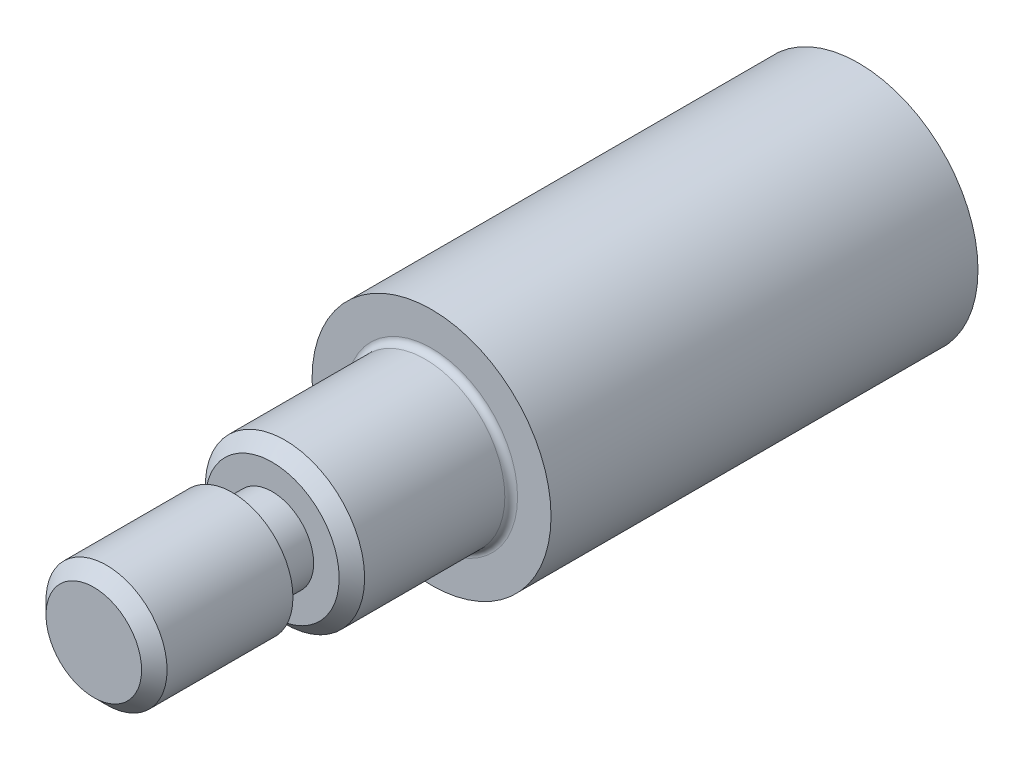
ISO-10303-21;
HEADER;
FILE_DESCRIPTION(('STEP AP214'),'2;1');
FILE_NAME('part.step','',(''),(''),'','','');
FILE_SCHEMA(('AUTOMOTIVE_DESIGN { 1 0 10303 214 1 1 1 1 }'));
ENDSEC;
DATA;
#1=APPLICATION_CONTEXT('core data for automotive mechanical design processes');
#2=APPLICATION_PROTOCOL_DEFINITION('international standard','automotive_design',2000,#1);
#3=PRODUCT_CONTEXT('',#1,'mechanical');
#4=PRODUCT('Part','Part','',(#3));
#5=PRODUCT_RELATED_PRODUCT_CATEGORY('part','',(#4));
#6=PRODUCT_DEFINITION_FORMATION('','',#4);
#7=PRODUCT_DEFINITION_CONTEXT('part definition',#1,'design');
#8=PRODUCT_DEFINITION('design','',#6,#7);
#9=PRODUCT_DEFINITION_SHAPE('','',#8);
#10=(LENGTH_UNIT() NAMED_UNIT(*) SI_UNIT(.MILLI.,.METRE.));
#11=(NAMED_UNIT(*) PLANE_ANGLE_UNIT() SI_UNIT($,.RADIAN.));
#12=(NAMED_UNIT(*) SI_UNIT($,.STERADIAN.) SOLID_ANGLE_UNIT());
#13=UNCERTAINTY_MEASURE_WITH_UNIT(LENGTH_MEASURE(1.E-05),#10,'distance_accuracy_value','');
#14=(GEOMETRIC_REPRESENTATION_CONTEXT(3) GLOBAL_UNCERTAINTY_ASSIGNED_CONTEXT((#13)) GLOBAL_UNIT_ASSIGNED_CONTEXT((#10,
#11,#12)) REPRESENTATION_CONTEXT('',''));
#15=CARTESIAN_POINT('',(0.,0.,0.));
#16=DIRECTION('',(0.,0.,1.));
#17=DIRECTION('',(1.,0.,0.));
#18=AXIS2_PLACEMENT_3D('',#15,#16,#17);
#19=CARTESIAN_POINT('',(0.,0.,23.368));
#20=DIRECTION('',(0.,0.,1.));
#21=DIRECTION('',(1.,0.,0.));
#22=AXIS2_PLACEMENT_3D('',#19,#20,#21);
#23=PLANE('',#22);
#24=CARTESIAN_POINT('',(0.,0.,23.368));
#25=DIRECTION('',(0.,0.,1.));
#26=DIRECTION('',(1.,0.,0.));
#27=AXIS2_PLACEMENT_3D('',#24,#25,#26);
#28=CIRCLE('',#27,2.667);
#29=CARTESIAN_POINT('',(2.667,0.,23.368));
#30=VERTEX_POINT('',#29);
#31=EDGE_CURVE('E84',#30,#30,#28,.T.);
#32=ORIENTED_EDGE('',*,*,#31,.T.);
#33=EDGE_LOOP('',(#32));
#34=FACE_BOUND('',#33,.T.);
#35=CARTESIAN_POINT('',(0.,0.,23.368));
#36=DIRECTION('',(0.,0.,1.));
#37=DIRECTION('',(1.,0.,0.));
#38=AXIS2_PLACEMENT_3D('',#35,#36,#37);
#39=CIRCLE('',#38,1.651);
#40=CARTESIAN_POINT('',(1.651,0.,23.368));
#41=VERTEX_POINT('',#40);
#42=EDGE_CURVE('E162',#41,#41,#39,.T.);
#43=ORIENTED_EDGE('',*,*,#42,.F.);
#44=EDGE_LOOP('',(#43));
#45=FACE_BOUND('',#44,.T.);
#46=ADVANCED_FACE('F39',(#34,#45),#23,.T.);
#47=CARTESIAN_POINT('',(0.,0.,17.018));
#48=DIRECTION('',(0.,0.,1.));
#49=DIRECTION('',(1.,0.,0.));
#50=AXIS2_PLACEMENT_3D('',#47,#48,#49);
#51=PLANE('',#50);
#52=CARTESIAN_POINT('',(0.,0.,17.018));
#53=DIRECTION('',(0.,0.,1.));
#54=DIRECTION('',(1.,0.,0.));
#55=AXIS2_PLACEMENT_3D('',#52,#53,#54);
#56=CIRCLE('',#55,3.429);
#57=CARTESIAN_POINT('',(3.429,0.,17.018));
#58=VERTEX_POINT('',#57);
#59=EDGE_CURVE('E11',#58,#58,#56,.F.);
#60=ORIENTED_EDGE('',*,*,#59,.T.);
#61=EDGE_LOOP('',(#60));
#62=FACE_BOUND('',#61,.T.);
#63=CARTESIAN_POINT('',(0.,0.,17.018));
#64=DIRECTION('',(0.,0.,1.));
#65=DIRECTION('',(1.,0.,0.));
#66=AXIS2_PLACEMENT_3D('',#63,#64,#65);
#67=CIRCLE('',#66,4.7625);
#68=CARTESIAN_POINT('',(4.7625,0.,17.018));
#69=VERTEX_POINT('',#68);
#70=EDGE_CURVE('E63',#69,#69,#67,.T.);
#71=ORIENTED_EDGE('',*,*,#70,.T.);
#72=EDGE_LOOP('',(#71));
#73=FACE_BOUND('',#72,.T.);
#74=ADVANCED_FACE('F112',(#62,#73),#51,.T.);
#75=CARTESIAN_POINT('',(0.,0.,17.018));
#76=DIRECTION('',(0.,0.,-1.));
#77=DIRECTION('',(-1.,0.,0.));
#78=AXIS2_PLACEMENT_3D('',#75,#76,#77);
#79=CYLINDRICAL_SURFACE('',#78,4.7625);
#80=ORIENTED_EDGE('',*,*,#70,.F.);
#81=EDGE_LOOP('',(#80));
#82=FACE_BOUND('',#81,.T.);
#83=CARTESIAN_POINT('',(0.,0.,0.));
#84=DIRECTION('',(0.,0.,1.));
#85=DIRECTION('',(1.,0.,0.));
#86=AXIS2_PLACEMENT_3D('',#83,#84,#85);
#87=CIRCLE('',#86,4.7625);
#88=CARTESIAN_POINT('',(4.7625,0.,0.));
#89=VERTEX_POINT('',#88);
#90=EDGE_CURVE('E59',#89,#89,#87,.T.);
#91=ORIENTED_EDGE('',*,*,#90,.T.);
#92=EDGE_LOOP('',(#91));
#93=FACE_BOUND('',#92,.T.);
#94=ADVANCED_FACE('F118',(#82,#93),#79,.T.);
#95=CARTESIAN_POINT('',(0.,0.,0.));
#96=DIRECTION('',(0.,0.,1.));
#97=DIRECTION('',(1.,0.,0.));
#98=AXIS2_PLACEMENT_3D('',#95,#96,#97);
#99=PLANE('',#98);
#100=CARTESIAN_POINT('',(0.,0.,0.));
#101=DIRECTION('',(0.,0.,1.));
#102=DIRECTION('',(1.,0.,0.));
#103=AXIS2_PLACEMENT_3D('',#100,#101,#102);
#104=CIRCLE('',#103,3.44805);
#105=CARTESIAN_POINT('',(3.44805,0.,0.));
#106=VERTEX_POINT('',#105);
#107=EDGE_CURVE('E75',#106,#106,#104,.T.);
#108=ORIENTED_EDGE('',*,*,#107,.T.);
#109=EDGE_LOOP('',(#108));
#110=FACE_BOUND('',#109,.T.);
#111=ORIENTED_EDGE('',*,*,#90,.F.);
#112=EDGE_LOOP('',(#111));
#113=FACE_BOUND('',#112,.T.);
#114=ADVANCED_FACE('F126',(#110,#113),#99,.F.);
#115=CARTESIAN_POINT('',(0.,0.,23.368));
#116=DIRECTION('',(0.,0.,-1.));
#117=DIRECTION('',(-1.,0.,0.));
#118=AXIS2_PLACEMENT_3D('',#115,#116,#117);
#119=CYLINDRICAL_SURFACE('',#118,3.175);
#120=CARTESIAN_POINT('',(0.,0.,17.272));
#121=DIRECTION('',(0.,0.,1.));
#122=DIRECTION('',(1.,0.,0.));
#123=AXIS2_PLACEMENT_3D('',#120,#121,#122);
#124=CIRCLE('',#123,3.175);
#125=CARTESIAN_POINT('',(3.175,0.,17.272));
#126=VERTEX_POINT('',#125);
#127=EDGE_CURVE('E46',#126,#126,#124,.T.);
#128=ORIENTED_EDGE('',*,*,#127,.T.);
#129=EDGE_LOOP('',(#128));
#130=FACE_BOUND('',#129,.T.);
#131=CARTESIAN_POINT('',(0.,0.,22.86));
#132=DIRECTION('',(0.,0.,1.));
#133=DIRECTION('',(1.,0.,0.));
#134=AXIS2_PLACEMENT_3D('',#131,#132,#133);
#135=CIRCLE('',#134,3.175);
#136=CARTESIAN_POINT('',(3.175,0.,22.86));
#137=VERTEX_POINT('',#136);
#138=EDGE_CURVE('E87',#137,#137,#135,.F.);
#139=ORIENTED_EDGE('',*,*,#138,.T.);
#140=EDGE_LOOP('',(#139));
#141=FACE_BOUND('',#140,.T.);
#142=ADVANCED_FACE('F98',(#130,#141),#119,.T.);
#143=CARTESIAN_POINT('',(0.,0.,5.842));
#144=DIRECTION('',(0.,0.,-1.));
#145=DIRECTION('',(-1.,0.,0.));
#146=AXIS2_PLACEMENT_3D('',#143,#144,#145);
#147=CYLINDRICAL_SURFACE('',#146,3.19405);
#148=CARTESIAN_POINT('',(0.,0.,5.588));
#149=DIRECTION('',(0.,0.,-1.));
#150=DIRECTION('',(-1.,0.,0.));
#151=AXIS2_PLACEMENT_3D('',#148,#149,#150);
#152=CIRCLE('',#151,3.19405);
#153=CARTESIAN_POINT('',(-3.19405,0.,5.588));
#154=VERTEX_POINT('',#153);
#155=EDGE_CURVE('E81',#154,#154,#152,.F.);
#156=ORIENTED_EDGE('',*,*,#155,.T.);
#157=EDGE_LOOP('',(#156));
#158=FACE_BOUND('',#157,.T.);
#159=CARTESIAN_POINT('',(0.,0.,0.253999999999996));
#160=DIRECTION('',(0.,0.,1.));
#161=DIRECTION('',(1.,0.,0.));
#162=AXIS2_PLACEMENT_3D('',#159,#160,#161);
#163=CIRCLE('',#162,3.19405);
#164=CARTESIAN_POINT('',(3.19405,0.,0.253999999999996));
#165=VERTEX_POINT('',#164);
#166=EDGE_CURVE('E71',#165,#165,#163,.F.);
#167=ORIENTED_EDGE('',*,*,#166,.T.);
#168=EDGE_LOOP('',(#167));
#169=FACE_BOUND('',#168,.T.);
#170=ADVANCED_FACE('F125',(#158,#169),#147,.F.);
#171=CARTESIAN_POINT('',(0.,0.,5.842));
#172=DIRECTION('',(0.,0.,-1.));
#173=DIRECTION('',(-1.,0.,0.));
#174=AXIS2_PLACEMENT_3D('',#171,#172,#173);
#175=PLANE('',#174);
#176=CARTESIAN_POINT('',(0.,0.,5.842));
#177=DIRECTION('',(0.,0.,-1.));
#178=DIRECTION('',(-1.,0.,0.));
#179=AXIS2_PLACEMENT_3D('',#176,#177,#178);
#180=CIRCLE('',#179,1.89865);
#181=CARTESIAN_POINT('',(-1.89865,0.,5.842));
#182=VERTEX_POINT('',#181);
#183=EDGE_CURVE('E60',#182,#182,#180,.T.);
#184=ORIENTED_EDGE('',*,*,#183,.F.);
#185=EDGE_LOOP('',(#184));
#186=FACE_BOUND('',#185,.T.);
#187=CARTESIAN_POINT('',(0.,0.,5.842));
#188=DIRECTION('',(0.,0.,-1.));
#189=DIRECTION('',(-1.,0.,0.));
#190=AXIS2_PLACEMENT_3D('',#187,#188,#189);
#191=CIRCLE('',#190,2.94005);
#192=CARTESIAN_POINT('',(-2.94005,0.,5.842));
#193=VERTEX_POINT('',#192);
#194=EDGE_CURVE('E78',#193,#193,#191,.T.);
#195=ORIENTED_EDGE('',*,*,#194,.T.);
#196=EDGE_LOOP('',(#195));
#197=FACE_BOUND('',#196,.T.);
#198=ADVANCED_FACE('F138',(#186,#197),#175,.T.);
#199=CARTESIAN_POINT('',(0.,0.,0.253999999999996));
#200=DIRECTION('',(0.,0.,-1.));
#201=DIRECTION('',(-1.,0.,0.));
#202=AXIS2_PLACEMENT_3D('',#199,#200,#201);
#203=CONICAL_SURFACE('',#202,3.19405,0.785398163397452);
#204=ORIENTED_EDGE('',*,*,#107,.F.);
#205=EDGE_LOOP('',(#204));
#206=FACE_BOUND('',#205,.T.);
#207=ORIENTED_EDGE('',*,*,#166,.F.);
#208=EDGE_LOOP('',(#207));
#209=FACE_BOUND('',#208,.T.);
#210=ADVANCED_FACE('F134',(#206,#209),#203,.F.);
#211=CARTESIAN_POINT('',(0.,0.,5.588));
#212=DIRECTION('',(0.,0.,-1.));
#213=DIRECTION('',(-1.,0.,0.));
#214=AXIS2_PLACEMENT_3D('',#211,#212,#213);
#215=TOROIDAL_SURFACE('',#214,2.94005,0.254);
#216=ORIENTED_EDGE('',*,*,#155,.F.);
#217=EDGE_LOOP('',(#216));
#218=FACE_BOUND('',#217,.T.);
#219=ORIENTED_EDGE('',*,*,#194,.F.);
#220=EDGE_LOOP('',(#219));
#221=FACE_BOUND('',#220,.T.);
#222=ADVANCED_FACE('F137',(#218,#221),#215,.F.);
#223=CARTESIAN_POINT('',(0.,0.,23.368));
#224=DIRECTION('',(0.,0.,-1.));
#225=DIRECTION('',(-1.,0.,0.));
#226=AXIS2_PLACEMENT_3D('',#223,#224,#225);
#227=CONICAL_SURFACE('',#226,2.667,0.785398163397444);
#228=ORIENTED_EDGE('',*,*,#138,.F.);
#229=EDGE_LOOP('',(#228));
#230=FACE_BOUND('',#229,.T.);
#231=ORIENTED_EDGE('',*,*,#31,.F.);
#232=EDGE_LOOP('',(#231));
#233=FACE_BOUND('',#232,.T.);
#234=ADVANCED_FACE('F53',(#230,#233),#227,.T.);
#235=CARTESIAN_POINT('',(0.,0.,14.732));
#236=DIRECTION('',(0.,0.,-1.));
#237=DIRECTION('',(-1.,0.,0.));
#238=AXIS2_PLACEMENT_3D('',#235,#236,#237);
#239=CONICAL_SURFACE('',#238,1.89865,1.02974425867665);
#240=CARTESIAN_POINT('',(0.,0.,15.8728240143167));
#241=VERTEX_POINT('',#240);
#242=VERTEX_LOOP('',#241);
#243=FACE_BOUND('',#242,.T.);
#244=CARTESIAN_POINT('',(0.,0.,14.732));
#245=DIRECTION('',(0.,0.,-1.));
#246=DIRECTION('',(-1.,0.,0.));
#247=AXIS2_PLACEMENT_3D('',#244,#245,#246);
#248=CIRCLE('',#247,1.89865);
#249=CARTESIAN_POINT('',(-1.89865,0.,14.732));
#250=VERTEX_POINT('',#249);
#251=EDGE_CURVE('E57',#250,#250,#248,.T.);
#252=ORIENTED_EDGE('',*,*,#251,.T.);
#253=EDGE_LOOP('',(#252));
#254=FACE_BOUND('',#253,.T.);
#255=ADVANCED_FACE('F49',(#243,#254),#239,.F.);
#256=CARTESIAN_POINT('',(0.,0.,5.842));
#257=DIRECTION('',(0.,0.,-1.));
#258=DIRECTION('',(-1.,0.,0.));
#259=AXIS2_PLACEMENT_3D('',#256,#257,#258);
#260=CYLINDRICAL_SURFACE('',#259,1.89865);
#261=ORIENTED_EDGE('',*,*,#251,.F.);
#262=EDGE_LOOP('',(#261));
#263=FACE_BOUND('',#262,.T.);
#264=ORIENTED_EDGE('',*,*,#183,.T.);
#265=EDGE_LOOP('',(#264));
#266=FACE_BOUND('',#265,.T.);
#267=ADVANCED_FACE('F52',(#263,#266),#260,.F.);
#268=CARTESIAN_POINT('',(-2.413,0.,24.9555));
#269=DIRECTION('',(0.,0.,-1.));
#270=DIRECTION('',(-1.,0.,0.));
#271=AXIS2_PLACEMENT_3D('',#268,#269,#270);
#272=PLANE('',#271);
#273=CARTESIAN_POINT('',(0.,0.,24.9555));
#274=DIRECTION('',(0.,0.,1.));
#275=DIRECTION('',(1.,0.,0.));
#276=AXIS2_PLACEMENT_3D('',#273,#274,#275);
#277=CIRCLE('',#276,1.651);
#278=CARTESIAN_POINT('',(1.651,0.,24.9555));
#279=VERTEX_POINT('',#278);
#280=EDGE_CURVE('E160',#279,#279,#277,.T.);
#281=ORIENTED_EDGE('',*,*,#280,.T.);
#282=EDGE_LOOP('',(#281));
#283=FACE_BOUND('',#282,.T.);
#284=CARTESIAN_POINT('',(0.,0.,24.9555));
#285=DIRECTION('',(0.,0.,1.));
#286=DIRECTION('',(1.,0.,0.));
#287=AXIS2_PLACEMENT_3D('',#284,#285,#286);
#288=CIRCLE('',#287,2.413);
#289=CARTESIAN_POINT('',(2.413,0.,24.9555));
#290=VERTEX_POINT('',#289);
#291=EDGE_CURVE('E66',#290,#290,#288,.T.);
#292=ORIENTED_EDGE('',*,*,#291,.F.);
#293=EDGE_LOOP('',(#292));
#294=FACE_BOUND('',#293,.T.);
#295=ADVANCED_FACE('F170',(#283,#294),#272,.T.);
#296=CARTESIAN_POINT('',(0.,0.,29.9275859122081));
#297=DIRECTION('',(0.,0.,1.));
#298=DIRECTION('',(1.,0.,0.));
#299=AXIS2_PLACEMENT_3D('',#296,#297,#298);
#300=CYLINDRICAL_SURFACE('',#299,1.651);
#301=ORIENTED_EDGE('',*,*,#42,.T.);
#302=EDGE_LOOP('',(#301));
#303=FACE_BOUND('',#302,.T.);
#304=ORIENTED_EDGE('',*,*,#280,.F.);
#305=EDGE_LOOP('',(#304));
#306=FACE_BOUND('',#305,.T.);
#307=ADVANCED_FACE('F151',(#303,#306),#300,.T.);
#308=CARTESIAN_POINT('',(0.,0.,30.48));
#309=DIRECTION('',(0.,0.,1.));
#310=DIRECTION('',(1.,0.,0.));
#311=AXIS2_PLACEMENT_3D('',#308,#309,#310);
#312=PLANE('',#311);
#313=CARTESIAN_POINT('',(0.,0.,30.48));
#314=DIRECTION('',(0.,0.,1.));
#315=DIRECTION('',(1.,0.,0.));
#316=AXIS2_PLACEMENT_3D('',#313,#314,#315);
#317=CIRCLE('',#316,1.905);
#318=CARTESIAN_POINT('',(1.905,0.,30.48));
#319=VERTEX_POINT('',#318);
#320=EDGE_CURVE('E90',#319,#319,#317,.T.);
#321=ORIENTED_EDGE('',*,*,#320,.T.);
#322=EDGE_LOOP('',(#321));
#323=FACE_BOUND('',#322,.T.);
#324=ADVANCED_FACE('F146',(#323),#312,.T.);
#325=CARTESIAN_POINT('',(0.,0.,30.48));
#326=DIRECTION('',(0.,0.,-1.));
#327=DIRECTION('',(-1.,0.,0.));
#328=AXIS2_PLACEMENT_3D('',#325,#326,#327);
#329=CONICAL_SURFACE('',#328,1.905,0.78539816339745);
#330=CARTESIAN_POINT('',(0.,0.,29.972));
#331=DIRECTION('',(0.,0.,1.));
#332=DIRECTION('',(1.,0.,0.));
#333=AXIS2_PLACEMENT_3D('',#330,#331,#332);
#334=CIRCLE('',#333,2.413);
#335=CARTESIAN_POINT('',(2.413,0.,29.972));
#336=VERTEX_POINT('',#335);
#337=EDGE_CURVE('E93',#336,#336,#334,.F.);
#338=ORIENTED_EDGE('',*,*,#337,.F.);
#339=EDGE_LOOP('',(#338));
#340=FACE_BOUND('',#339,.T.);
#341=ORIENTED_EDGE('',*,*,#320,.F.);
#342=EDGE_LOOP('',(#341));
#343=FACE_BOUND('',#342,.T.);
#344=ADVANCED_FACE('F107',(#340,#343),#329,.T.);
#345=CARTESIAN_POINT('',(0.,0.,30.48));
#346=DIRECTION('',(0.,0.,-1.));
#347=DIRECTION('',(-1.,0.,0.));
#348=AXIS2_PLACEMENT_3D('',#345,#346,#347);
#349=CYLINDRICAL_SURFACE('',#348,2.413);
#350=ORIENTED_EDGE('',*,*,#337,.T.);
#351=EDGE_LOOP('',(#350));
#352=FACE_BOUND('',#351,.T.);
#353=ORIENTED_EDGE('',*,*,#291,.T.);
#354=EDGE_LOOP('',(#353));
#355=FACE_BOUND('',#354,.T.);
#356=ADVANCED_FACE('F102',(#352,#355),#349,.T.);
#357=CARTESIAN_POINT('',(0.,0.,17.272));
#358=DIRECTION('',(0.,0.,1.));
#359=DIRECTION('',(1.,0.,0.));
#360=AXIS2_PLACEMENT_3D('',#357,#358,#359);
#361=TOROIDAL_SURFACE('',#360,3.429,0.254);
#362=ORIENTED_EDGE('',*,*,#59,.F.);
#363=EDGE_LOOP('',(#362));
#364=FACE_BOUND('',#363,.T.);
#365=ORIENTED_EDGE('',*,*,#127,.F.);
#366=EDGE_LOOP('',(#365));
#367=FACE_BOUND('',#366,.T.);
#368=ADVANCED_FACE('F41',(#364,#367),#361,.F.);
#369=CLOSED_SHELL('',(#46,#74,#94,#114,#142,#170,#198,#210,#222,#234,#255,#267,#295,#307,#324,
#344,#356,#368));
#370=MANIFOLD_SOLID_BREP('B2',#369);
#371=ADVANCED_BREP_SHAPE_REPRESENTATION('',(#18,#370),#14);
#372=SHAPE_DEFINITION_REPRESENTATION(#9,#371);
ENDSEC;
END-ISO-10303-21;
